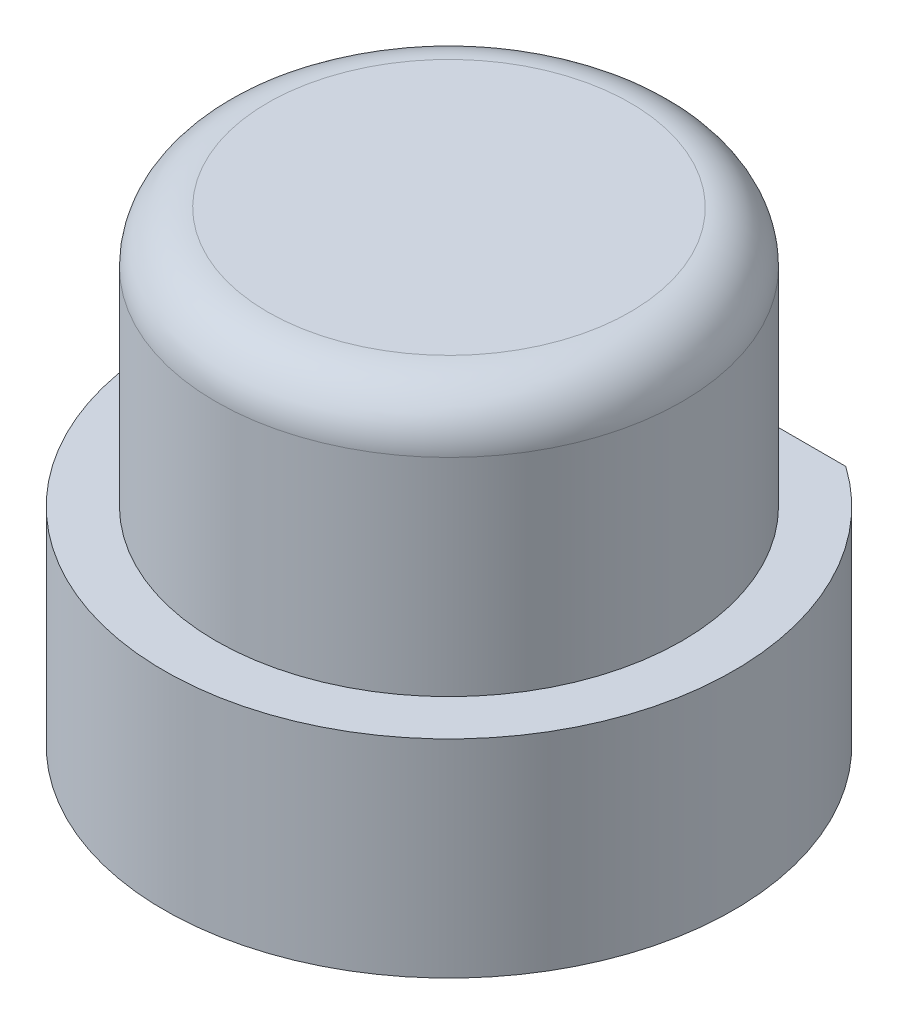
ISO-10303-21;
HEADER;
FILE_DESCRIPTION(('STEP AP214'),'2;1');
FILE_NAME('part.step','',(''),(''),'','','');
FILE_SCHEMA(('AUTOMOTIVE_DESIGN { 1 0 10303 214 1 1 1 1 }'));
ENDSEC;
DATA;
#1=APPLICATION_CONTEXT('core data for automotive mechanical design processes');
#2=APPLICATION_PROTOCOL_DEFINITION('international standard','automotive_design',2000,#1);
#3=PRODUCT_CONTEXT('',#1,'mechanical');
#4=PRODUCT('Part','Part','',(#3));
#5=PRODUCT_RELATED_PRODUCT_CATEGORY('part','',(#4));
#6=PRODUCT_DEFINITION_FORMATION('','',#4);
#7=PRODUCT_DEFINITION_CONTEXT('part definition',#1,'design');
#8=PRODUCT_DEFINITION('design','',#6,#7);
#9=PRODUCT_DEFINITION_SHAPE('','',#8);
#10=(LENGTH_UNIT() NAMED_UNIT(*) SI_UNIT(.MILLI.,.METRE.));
#11=(NAMED_UNIT(*) PLANE_ANGLE_UNIT() SI_UNIT($,.RADIAN.));
#12=(NAMED_UNIT(*) SI_UNIT($,.STERADIAN.) SOLID_ANGLE_UNIT());
#13=UNCERTAINTY_MEASURE_WITH_UNIT(LENGTH_MEASURE(1.E-05),#10,'distance_accuracy_value','');
#14=(GEOMETRIC_REPRESENTATION_CONTEXT(3) GLOBAL_UNCERTAINTY_ASSIGNED_CONTEXT((#13)) GLOBAL_UNIT_ASSIGNED_CONTEXT((#10,
#11,#12)) REPRESENTATION_CONTEXT('',''));
#15=CARTESIAN_POINT('',(0.,0.,0.));
#16=DIRECTION('',(0.,0.,1.));
#17=DIRECTION('',(1.,0.,0.));
#18=AXIS2_PLACEMENT_3D('',#15,#16,#17);
#19=CARTESIAN_POINT('',(0.,9.,0.));
#20=DIRECTION('',(0.,-1.,0.));
#21=DIRECTION('',(0.,0.,-1.));
#22=AXIS2_PLACEMENT_3D('',#19,#20,#21);
#23=CYLINDRICAL_SURFACE('',#22,5.5);
#24=CARTESIAN_POINT('',(0.,4.,0.));
#25=DIRECTION('',(0.,1.,0.));
#26=DIRECTION('',(0.,0.,1.));
#27=AXIS2_PLACEMENT_3D('',#24,#25,#26);
#28=CIRCLE('',#27,5.5);
#29=CARTESIAN_POINT('',(-3.16227766016838,4.,-4.5));
#30=VERTEX_POINT('',#29);
#31=CARTESIAN_POINT('',(3.16227766016838,4.,-4.5));
#32=VERTEX_POINT('',#31);
#33=EDGE_CURVE('E67',#30,#32,#28,.T.);
#34=ORIENTED_EDGE('',*,*,#33,.F.);
#35=DIRECTION('',(0.,-1.,0.));
#36=VECTOR('',#35,1.);
#37=CARTESIAN_POINT('',(-3.16227766016838,9.,-4.5));
#38=LINE('',#37,#36);
#39=CARTESIAN_POINT('',(-3.16227766016838,0.,-4.5));
#40=VERTEX_POINT('',#39);
#41=EDGE_CURVE('E55',#30,#40,#38,.T.);
#42=ORIENTED_EDGE('',*,*,#41,.T.);
#43=CARTESIAN_POINT('',(0.,0.,0.));
#44=DIRECTION('',(0.,1.,0.));
#45=DIRECTION('',(0.,0.,1.));
#46=AXIS2_PLACEMENT_3D('',#43,#44,#45);
#47=CIRCLE('',#46,5.5);
#48=CARTESIAN_POINT('',(3.16227766016838,0.,-4.5));
#49=VERTEX_POINT('',#48);
#50=EDGE_CURVE('E82',#40,#49,#47,.T.);
#51=ORIENTED_EDGE('',*,*,#50,.T.);
#52=DIRECTION('',(0.,-1.,0.));
#53=VECTOR('',#52,1.);
#54=CARTESIAN_POINT('',(3.16227766016838,9.,-4.5));
#55=LINE('',#54,#53);
#56=EDGE_CURVE('E71',#32,#49,#55,.T.);
#57=ORIENTED_EDGE('',*,*,#56,.F.);
#58=EDGE_LOOP('',(#34,#42,#51,#57));
#59=FACE_BOUND('',#58,.T.);
#60=ADVANCED_FACE('F33',(#59),#23,.T.);
#61=CARTESIAN_POINT('',(3.16227766016838,9.,-4.5));
#62=DIRECTION('',(0.,0.,1.));
#63=DIRECTION('',(1.,0.,0.));
#64=AXIS2_PLACEMENT_3D('',#61,#62,#63);
#65=PLANE('',#64);
#66=DIRECTION('',(-1.,0.,0.));
#67=VECTOR('',#66,1.);
#68=CARTESIAN_POINT('',(3.16227766016838,4.,-4.5));
#69=LINE('',#68,#67);
#70=CARTESIAN_POINT('',(0.,4.,-4.5));
#71=VERTEX_POINT('',#70);
#72=EDGE_CURVE('E70',#32,#71,#69,.T.);
#73=ORIENTED_EDGE('',*,*,#72,.F.);
#74=ORIENTED_EDGE('',*,*,#56,.T.);
#75=DIRECTION('',(-1.,0.,0.));
#76=VECTOR('',#75,1.);
#77=CARTESIAN_POINT('',(3.16227766016838,0.,-4.5));
#78=LINE('',#77,#76);
#79=EDGE_CURVE('E78',#49,#40,#78,.T.);
#80=ORIENTED_EDGE('',*,*,#79,.T.);
#81=ORIENTED_EDGE('',*,*,#41,.F.);
#82=EDGE_CURVE('E65',#71,#30,#69,.T.);
#83=ORIENTED_EDGE('',*,*,#82,.F.);
#84=EDGE_LOOP('',(#73,#74,#80,#81,#83));
#85=FACE_BOUND('',#84,.T.);
#86=ADVANCED_FACE('F76',(#85),#65,.F.);
#87=CARTESIAN_POINT('',(0.,0.,0.));
#88=DIRECTION('',(0.,1.,0.));
#89=DIRECTION('',(0.,0.,1.));
#90=AXIS2_PLACEMENT_3D('',#87,#88,#89);
#91=PLANE('',#90);
#92=CARTESIAN_POINT('',(0.,0.,0.));
#93=DIRECTION('',(0.,-1.,0.));
#94=DIRECTION('',(0.,0.,-1.));
#95=AXIS2_PLACEMENT_3D('',#92,#93,#94);
#96=CIRCLE('',#95,3.5);
#97=CARTESIAN_POINT('',(0.,0.,-3.5));
#98=VERTEX_POINT('',#97);
#99=EDGE_CURVE('E74',#98,#98,#96,.T.);
#100=ORIENTED_EDGE('',*,*,#99,.F.);
#101=EDGE_LOOP('',(#100));
#102=FACE_BOUND('',#101,.T.);
#103=ORIENTED_EDGE('',*,*,#50,.F.);
#104=ORIENTED_EDGE('',*,*,#79,.F.);
#105=EDGE_LOOP('',(#103,#104));
#106=FACE_BOUND('',#105,.T.);
#107=ADVANCED_FACE('F89',(#102,#106),#91,.F.);
#108=CARTESIAN_POINT('',(0.,1.5,0.));
#109=DIRECTION('',(0.,-1.,0.));
#110=DIRECTION('',(0.,0.,-1.));
#111=AXIS2_PLACEMENT_3D('',#108,#109,#110);
#112=CYLINDRICAL_SURFACE('',#111,3.5);
#113=CARTESIAN_POINT('',(0.,1.5,0.));
#114=DIRECTION('',(0.,-1.,0.));
#115=DIRECTION('',(0.,0.,-1.));
#116=AXIS2_PLACEMENT_3D('',#113,#114,#115);
#117=CIRCLE('',#116,3.5);
#118=CARTESIAN_POINT('',(0.,1.5,-3.5));
#119=VERTEX_POINT('',#118);
#120=EDGE_CURVE('E90',#119,#119,#117,.T.);
#121=ORIENTED_EDGE('',*,*,#120,.F.);
#122=EDGE_LOOP('',(#121));
#123=FACE_BOUND('',#122,.T.);
#124=ORIENTED_EDGE('',*,*,#99,.T.);
#125=EDGE_LOOP('',(#124));
#126=FACE_BOUND('',#125,.T.);
#127=ADVANCED_FACE('F116',(#123,#126),#112,.F.);
#128=CARTESIAN_POINT('',(0.,1.5,0.));
#129=DIRECTION('',(0.,-1.,0.));
#130=DIRECTION('',(0.,0.,-1.));
#131=AXIS2_PLACEMENT_3D('',#128,#129,#130);
#132=PLANE('',#131);
#133=ORIENTED_EDGE('',*,*,#120,.T.);
#134=EDGE_LOOP('',(#133));
#135=FACE_BOUND('',#134,.T.);
#136=ADVANCED_FACE('F107',(#135),#132,.T.);
#137=CARTESIAN_POINT('',(0.,4.,0.));
#138=DIRECTION('',(0.,1.,0.));
#139=DIRECTION('',(0.,0.,1.));
#140=AXIS2_PLACEMENT_3D('',#137,#138,#139);
#141=PLANE('',#140);
#142=ORIENTED_EDGE('',*,*,#33,.T.);
#143=ORIENTED_EDGE('',*,*,#72,.T.);
#144=CARTESIAN_POINT('',(0.,4.,0.));
#145=DIRECTION('',(0.,1.,0.));
#146=DIRECTION('',(0.,0.,1.));
#147=AXIS2_PLACEMENT_3D('',#144,#145,#146);
#148=CIRCLE('',#147,4.5);
#149=EDGE_CURVE('E48',#71,#71,#148,.T.);
#150=ORIENTED_EDGE('',*,*,#149,.F.);
#151=ORIENTED_EDGE('',*,*,#82,.T.);
#152=EDGE_LOOP('',(#142,#143,#150,#151));
#153=FACE_BOUND('',#152,.T.);
#154=ADVANCED_FACE('F66',(#153),#141,.T.);
#155=CARTESIAN_POINT('',(0.,4.,0.));
#156=DIRECTION('',(0.,1.,0.));
#157=DIRECTION('',(0.,0.,1.));
#158=AXIS2_PLACEMENT_3D('',#155,#156,#157);
#159=CYLINDRICAL_SURFACE('',#158,4.5);
#160=CARTESIAN_POINT('',(0.,8.,0.));
#161=DIRECTION('',(0.,1.,0.));
#162=DIRECTION('',(0.,0.,1.));
#163=AXIS2_PLACEMENT_3D('',#160,#161,#162);
#164=CIRCLE('',#163,4.5);
#165=CARTESIAN_POINT('',(0.,8.,4.5));
#166=VERTEX_POINT('',#165);
#167=EDGE_CURVE('E11',#166,#166,#164,.F.);
#168=ORIENTED_EDGE('',*,*,#167,.T.);
#169=EDGE_LOOP('',(#168));
#170=FACE_BOUND('',#169,.T.);
#171=ORIENTED_EDGE('',*,*,#149,.T.);
#172=EDGE_LOOP('',(#171));
#173=FACE_BOUND('',#172,.T.);
#174=ADVANCED_FACE('F97',(#170,#173),#159,.T.);
#175=CARTESIAN_POINT('',(0.,9.,0.));
#176=DIRECTION('',(0.,1.,0.));
#177=DIRECTION('',(0.,0.,1.));
#178=AXIS2_PLACEMENT_3D('',#175,#176,#177);
#179=PLANE('',#178);
#180=CARTESIAN_POINT('',(0.,9.,0.));
#181=DIRECTION('',(0.,1.,0.));
#182=DIRECTION('',(0.,0.,1.));
#183=AXIS2_PLACEMENT_3D('',#180,#181,#182);
#184=CIRCLE('',#183,3.5);
#185=CARTESIAN_POINT('',(0.,9.,3.5));
#186=VERTEX_POINT('',#185);
#187=EDGE_CURVE('E41',#186,#186,#184,.T.);
#188=ORIENTED_EDGE('',*,*,#187,.T.);
#189=EDGE_LOOP('',(#188));
#190=FACE_BOUND('',#189,.T.);
#191=ADVANCED_FACE('F99',(#190),#179,.T.);
#192=CARTESIAN_POINT('',(0.,8.,0.));
#193=DIRECTION('',(0.,1.,0.));
#194=DIRECTION('',(0.,0.,1.));
#195=AXIS2_PLACEMENT_3D('',#192,#193,#194);
#196=TOROIDAL_SURFACE('',#195,3.5,1.);
#197=ORIENTED_EDGE('',*,*,#167,.F.);
#198=EDGE_LOOP('',(#197));
#199=FACE_BOUND('',#198,.T.);
#200=ORIENTED_EDGE('',*,*,#187,.F.);
#201=EDGE_LOOP('',(#200));
#202=FACE_BOUND('',#201,.T.);
#203=ADVANCED_FACE('F35',(#199,#202),#196,.T.);
#204=CLOSED_SHELL('',(#60,#86,#107,#127,#136,#154,#174,#191,#203));
#205=MANIFOLD_SOLID_BREP('B2',#204);
#206=ADVANCED_BREP_SHAPE_REPRESENTATION('',(#18,#205),#14);
#207=SHAPE_DEFINITION_REPRESENTATION(#9,#206);
ENDSEC;
END-ISO-10303-21;
